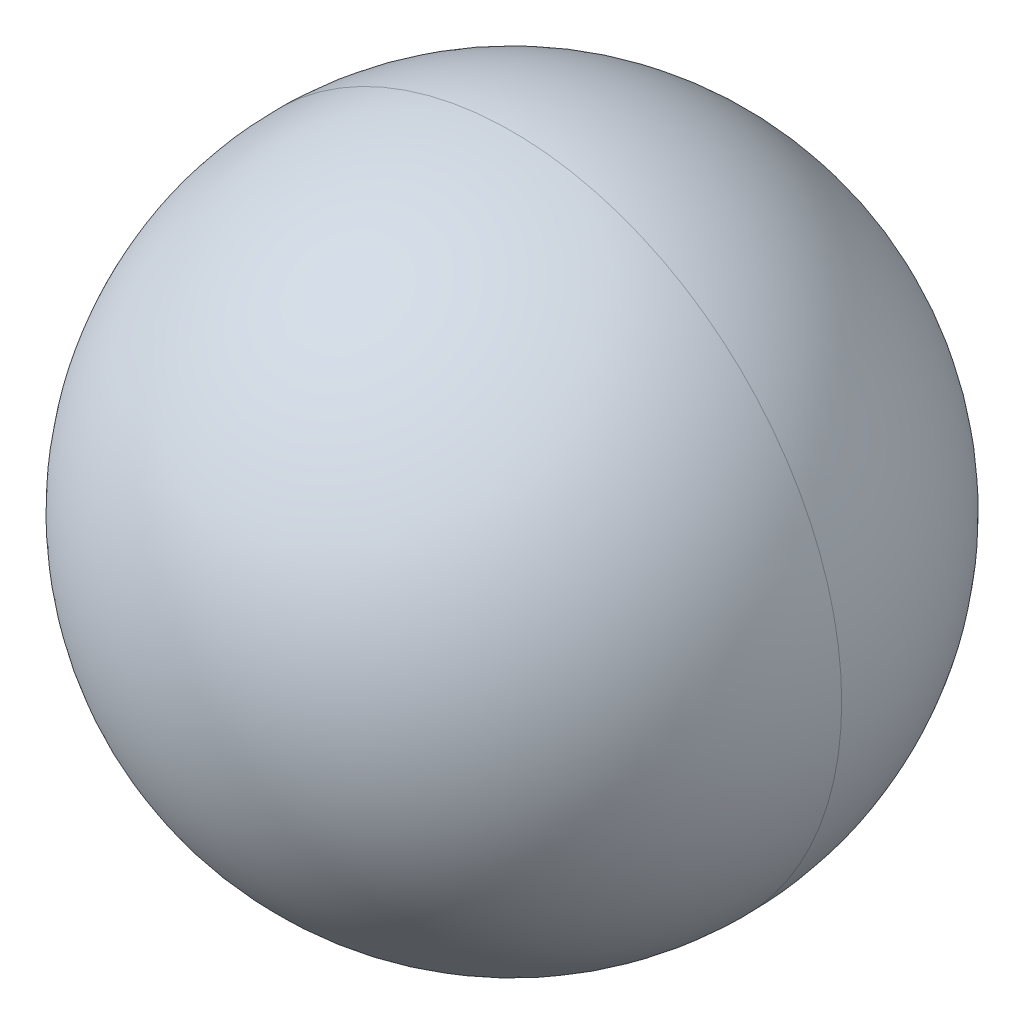
ISO-10303-21;
HEADER;
FILE_DESCRIPTION(('STEP AP214'),'2;1');
FILE_NAME('part.step','',(''),(''),'','','');
FILE_SCHEMA(('AUTOMOTIVE_DESIGN { 1 0 10303 214 1 1 1 1 }'));
ENDSEC;
DATA;
#1=APPLICATION_CONTEXT('core data for automotive mechanical design processes');
#2=APPLICATION_PROTOCOL_DEFINITION('international standard','automotive_design',2000,#1);
#3=PRODUCT_CONTEXT('',#1,'mechanical');
#4=PRODUCT('Part','Part','',(#3));
#5=PRODUCT_RELATED_PRODUCT_CATEGORY('part','',(#4));
#6=PRODUCT_DEFINITION_FORMATION('','',#4);
#7=PRODUCT_DEFINITION_CONTEXT('part definition',#1,'design');
#8=PRODUCT_DEFINITION('design','',#6,#7);
#9=PRODUCT_DEFINITION_SHAPE('','',#8);
#10=(LENGTH_UNIT() NAMED_UNIT(*) SI_UNIT(.MILLI.,.METRE.));
#11=(NAMED_UNIT(*) PLANE_ANGLE_UNIT() SI_UNIT($,.RADIAN.));
#12=(NAMED_UNIT(*) SI_UNIT($,.STERADIAN.) SOLID_ANGLE_UNIT());
#13=UNCERTAINTY_MEASURE_WITH_UNIT(LENGTH_MEASURE(1.E-05),#10,'distance_accuracy_value','');
#14=(GEOMETRIC_REPRESENTATION_CONTEXT(3) GLOBAL_UNCERTAINTY_ASSIGNED_CONTEXT((#13)) GLOBAL_UNIT_ASSIGNED_CONTEXT((#10,
#11,#12)) REPRESENTATION_CONTEXT('',''));
#15=CARTESIAN_POINT('',(0.,0.,0.));
#16=DIRECTION('',(0.,0.,1.));
#17=DIRECTION('',(1.,0.,0.));
#18=AXIS2_PLACEMENT_3D('',#15,#16,#17);
#19=CARTESIAN_POINT('',(3.,6.95,0.));
#20=DIRECTION('',(1.,0.,0.));
#21=DIRECTION('',(0.,0.,-1.));
#22=AXIS2_PLACEMENT_3D('',#19,#20,#21);
#23=SPHERICAL_SURFACE('',#22,1.5875);
#24=CARTESIAN_POINT('',(3.,6.95,0.));
#25=DIRECTION('',(0.,0.,1.));
#26=DIRECTION('',(1.,0.,0.));
#27=AXIS2_PLACEMENT_3D('',#24,#25,#26);
#28=CIRCLE('',#27,1.5875);
#29=CARTESIAN_POINT('',(4.5875,6.95,0.));
#30=VERTEX_POINT('',#29);
#31=CARTESIAN_POINT('',(1.4125,6.95,0.));
#32=VERTEX_POINT('',#31);
#33=EDGE_CURVE('E10',#30,#32,#28,.T.);
#34=ORIENTED_EDGE('',*,*,#33,.T.);
#35=CARTESIAN_POINT('',(3.,6.95,0.));
#36=DIRECTION('',(0.,0.,-1.));
#37=DIRECTION('',(1.,0.,0.));
#38=AXIS2_PLACEMENT_3D('',#35,#36,#37);
#39=CIRCLE('',#38,1.5875);
#40=EDGE_CURVE('E23',#30,#32,#39,.T.);
#41=ORIENTED_EDGE('',*,*,#40,.F.);
#42=EDGE_LOOP('',(#34,#41));
#43=FACE_BOUND('',#42,.T.);
#44=ADVANCED_FACE('F15',(#43),#23,.T.);
#45=CARTESIAN_POINT('',(3.,6.95,0.));
#46=DIRECTION('',(1.,0.,0.));
#47=DIRECTION('',(0.,0.,1.));
#48=AXIS2_PLACEMENT_3D('',#45,#46,#47);
#49=SPHERICAL_SURFACE('',#48,1.5875);
#50=ORIENTED_EDGE('',*,*,#33,.F.);
#51=ORIENTED_EDGE('',*,*,#40,.T.);
#52=EDGE_LOOP('',(#50,#51));
#53=FACE_BOUND('',#52,.T.);
#54=ADVANCED_FACE('F31',(#53),#49,.T.);
#55=CLOSED_SHELL('',(#44,#54));
#56=MANIFOLD_SOLID_BREP('B1',#55);
#57=ADVANCED_BREP_SHAPE_REPRESENTATION('',(#18,#56),#14);
#58=SHAPE_DEFINITION_REPRESENTATION(#9,#57);
ENDSEC;
END-ISO-10303-21;
